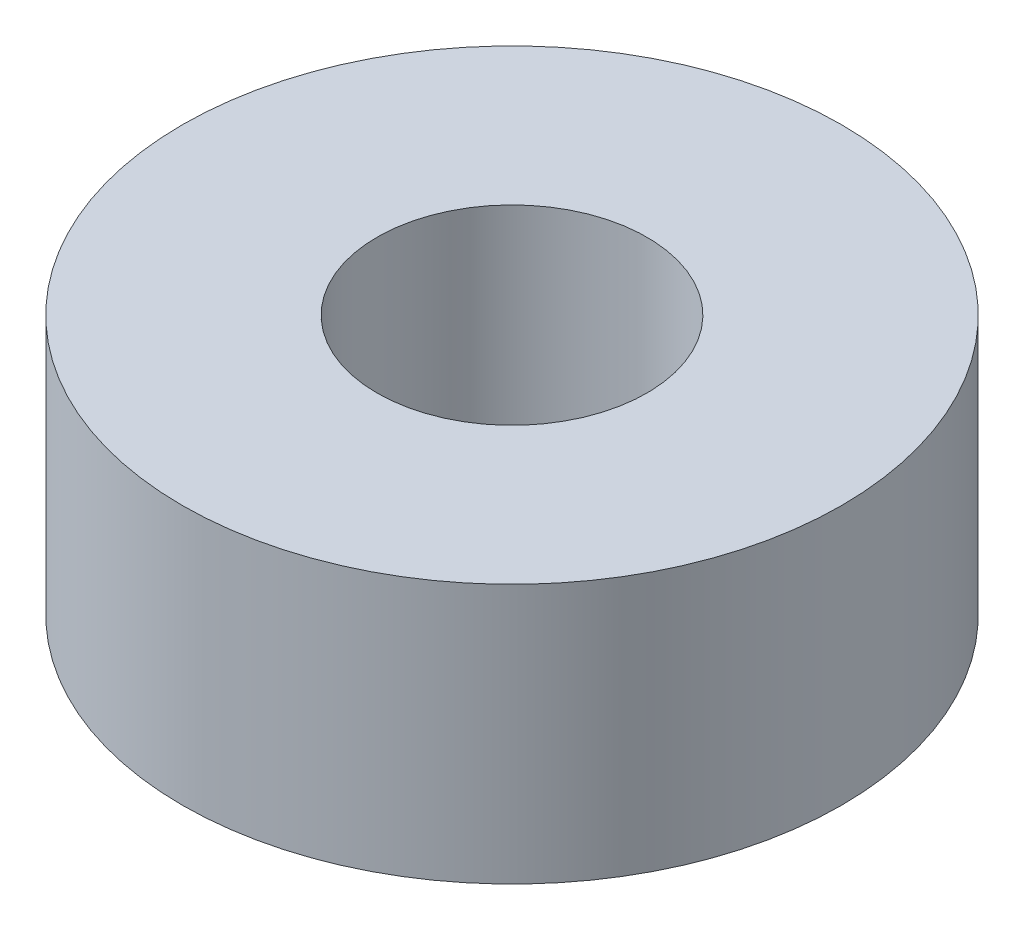
ISO-10303-21;
HEADER;
FILE_DESCRIPTION(('STEP AP214'),'2;1');
FILE_NAME('part.step','',(''),(''),'','','');
FILE_SCHEMA(('AUTOMOTIVE_DESIGN { 1 0 10303 214 1 1 1 1 }'));
ENDSEC;
DATA;
#1=APPLICATION_CONTEXT('core data for automotive mechanical design processes');
#2=APPLICATION_PROTOCOL_DEFINITION('international standard','automotive_design',2000,#1);
#3=PRODUCT_CONTEXT('',#1,'mechanical');
#4=PRODUCT('Part','Part','',(#3));
#5=PRODUCT_RELATED_PRODUCT_CATEGORY('part','',(#4));
#6=PRODUCT_DEFINITION_FORMATION('','',#4);
#7=PRODUCT_DEFINITION_CONTEXT('part definition',#1,'design');
#8=PRODUCT_DEFINITION('design','',#6,#7);
#9=PRODUCT_DEFINITION_SHAPE('','',#8);
#10=(LENGTH_UNIT() NAMED_UNIT(*) SI_UNIT(.MILLI.,.METRE.));
#11=(NAMED_UNIT(*) PLANE_ANGLE_UNIT() SI_UNIT($,.RADIAN.));
#12=(NAMED_UNIT(*) SI_UNIT($,.STERADIAN.) SOLID_ANGLE_UNIT());
#13=UNCERTAINTY_MEASURE_WITH_UNIT(LENGTH_MEASURE(1.E-05),#10,'distance_accuracy_value','');
#14=(GEOMETRIC_REPRESENTATION_CONTEXT(3) GLOBAL_UNCERTAINTY_ASSIGNED_CONTEXT((#13)) GLOBAL_UNIT_ASSIGNED_CONTEXT((#10,
#11,#12)) REPRESENTATION_CONTEXT('',''));
#15=CARTESIAN_POINT('',(0.,0.,0.));
#16=DIRECTION('',(0.,0.,1.));
#17=DIRECTION('',(1.,0.,0.));
#18=AXIS2_PLACEMENT_3D('',#15,#16,#17);
#19=CARTESIAN_POINT('',(0.,3.175,0.));
#20=DIRECTION('',(0.,1.,0.));
#21=DIRECTION('',(0.,0.,1.));
#22=AXIS2_PLACEMENT_3D('',#19,#20,#21);
#23=PLANE('',#22);
#24=CARTESIAN_POINT('',(0.,3.175,0.));
#25=DIRECTION('',(0.,1.,0.));
#26=DIRECTION('',(0.,0.,1.));
#27=AXIS2_PLACEMENT_3D('',#24,#25,#26);
#28=CIRCLE('',#27,8.0645);
#29=CARTESIAN_POINT('',(0.,3.175,8.0645));
#30=VERTEX_POINT('',#29);
#31=EDGE_CURVE('E10',#30,#30,#28,.T.);
#32=ORIENTED_EDGE('',*,*,#31,.T.);
#33=EDGE_LOOP('',(#32));
#34=FACE_BOUND('',#33,.T.);
#35=CARTESIAN_POINT('',(0.,3.175,0.));
#36=DIRECTION('',(0.,1.,0.));
#37=DIRECTION('',(0.,0.,1.));
#38=AXIS2_PLACEMENT_3D('',#35,#36,#37);
#39=CIRCLE('',#38,3.302);
#40=CARTESIAN_POINT('',(0.,3.175,3.302));
#41=VERTEX_POINT('',#40);
#42=EDGE_CURVE('E50',#41,#41,#39,.T.);
#43=ORIENTED_EDGE('',*,*,#42,.F.);
#44=EDGE_LOOP('',(#43));
#45=FACE_BOUND('',#44,.T.);
#46=ADVANCED_FACE('F37',(#34,#45),#23,.T.);
#47=CARTESIAN_POINT('',(0.,-3.175,0.));
#48=DIRECTION('',(0.,1.,0.));
#49=DIRECTION('',(0.,0.,1.));
#50=AXIS2_PLACEMENT_3D('',#47,#48,#49);
#51=PLANE('',#50);
#52=CARTESIAN_POINT('',(0.,-3.175,0.));
#53=DIRECTION('',(0.,1.,0.));
#54=DIRECTION('',(0.,0.,1.));
#55=AXIS2_PLACEMENT_3D('',#52,#53,#54);
#56=CIRCLE('',#55,8.0645);
#57=CARTESIAN_POINT('',(0.,-3.175,8.0645));
#58=VERTEX_POINT('',#57);
#59=EDGE_CURVE('E41',#58,#58,#56,.T.);
#60=ORIENTED_EDGE('',*,*,#59,.F.);
#61=EDGE_LOOP('',(#60));
#62=FACE_BOUND('',#61,.T.);
#63=CARTESIAN_POINT('',(0.,-3.175,0.));
#64=DIRECTION('',(0.,1.,0.));
#65=DIRECTION('',(0.,0.,1.));
#66=AXIS2_PLACEMENT_3D('',#63,#64,#65);
#67=CIRCLE('',#66,3.302);
#68=CARTESIAN_POINT('',(0.,-3.175,3.302));
#69=VERTEX_POINT('',#68);
#70=EDGE_CURVE('E52',#69,#69,#67,.T.);
#71=ORIENTED_EDGE('',*,*,#70,.T.);
#72=EDGE_LOOP('',(#71));
#73=FACE_BOUND('',#72,.T.);
#74=ADVANCED_FACE('F64',(#62,#73),#51,.F.);
#75=CARTESIAN_POINT('',(0.,3.175,0.));
#76=DIRECTION('',(0.,-1.,0.));
#77=DIRECTION('',(0.,0.,-1.));
#78=AXIS2_PLACEMENT_3D('',#75,#76,#77);
#79=CYLINDRICAL_SURFACE('',#78,8.0645);
#80=ORIENTED_EDGE('',*,*,#31,.F.);
#81=EDGE_LOOP('',(#80));
#82=FACE_BOUND('',#81,.T.);
#83=ORIENTED_EDGE('',*,*,#59,.T.);
#84=EDGE_LOOP('',(#83));
#85=FACE_BOUND('',#84,.T.);
#86=ADVANCED_FACE('F39',(#82,#85),#79,.T.);
#87=CARTESIAN_POINT('',(0.,3.175,0.));
#88=DIRECTION('',(0.,-1.,0.));
#89=DIRECTION('',(0.,0.,-1.));
#90=AXIS2_PLACEMENT_3D('',#87,#88,#89);
#91=CYLINDRICAL_SURFACE('',#90,3.302);
#92=ORIENTED_EDGE('',*,*,#42,.T.);
#93=EDGE_LOOP('',(#92));
#94=FACE_BOUND('',#93,.T.);
#95=ORIENTED_EDGE('',*,*,#70,.F.);
#96=EDGE_LOOP('',(#95));
#97=FACE_BOUND('',#96,.T.);
#98=ADVANCED_FACE('F60',(#94,#97),#91,.F.);
#99=CLOSED_SHELL('',(#46,#74,#86,#98));
#100=MANIFOLD_SOLID_BREP('B2',#99);
#101=ADVANCED_BREP_SHAPE_REPRESENTATION('',(#18,#100),#14);
#102=SHAPE_DEFINITION_REPRESENTATION(#9,#101);
ENDSEC;
END-ISO-10303-21;
